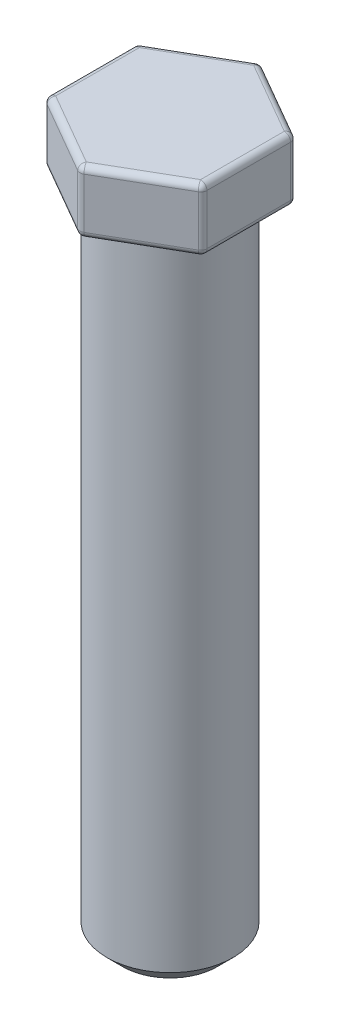
ISO-10303-21;
HEADER;
FILE_DESCRIPTION(('STEP AP214'),'2;1');
FILE_NAME('part.step','',(''),(''),'','','');
FILE_SCHEMA(('AUTOMOTIVE_DESIGN { 1 0 10303 214 1 1 1 1 }'));
ENDSEC;
DATA;
#1=APPLICATION_CONTEXT('core data for automotive mechanical design processes');
#2=APPLICATION_PROTOCOL_DEFINITION('international standard','automotive_design',2000,#1);
#3=PRODUCT_CONTEXT('',#1,'mechanical');
#4=PRODUCT('Part','Part','',(#3));
#5=PRODUCT_RELATED_PRODUCT_CATEGORY('part','',(#4));
#6=PRODUCT_DEFINITION_FORMATION('','',#4);
#7=PRODUCT_DEFINITION_CONTEXT('part definition',#1,'design');
#8=PRODUCT_DEFINITION('design','',#6,#7);
#9=PRODUCT_DEFINITION_SHAPE('','',#8);
#10=(LENGTH_UNIT() NAMED_UNIT(*) SI_UNIT(.MILLI.,.METRE.));
#11=(NAMED_UNIT(*) PLANE_ANGLE_UNIT() SI_UNIT($,.RADIAN.));
#12=(NAMED_UNIT(*) SI_UNIT($,.STERADIAN.) SOLID_ANGLE_UNIT());
#13=UNCERTAINTY_MEASURE_WITH_UNIT(LENGTH_MEASURE(1.E-05),#10,'distance_accuracy_value','');
#14=(GEOMETRIC_REPRESENTATION_CONTEXT(3) GLOBAL_UNCERTAINTY_ASSIGNED_CONTEXT((#13)) GLOBAL_UNIT_ASSIGNED_CONTEXT((#10,
#11,#12)) REPRESENTATION_CONTEXT('',''));
#15=CARTESIAN_POINT('',(0.,0.,0.));
#16=DIRECTION('',(0.,0.,1.));
#17=DIRECTION('',(1.,0.,0.));
#18=AXIS2_PLACEMENT_3D('',#15,#16,#17);
#19=CARTESIAN_POINT('',(0.,20.7,0.));
#20=DIRECTION('',(0.,-1.,0.));
#21=DIRECTION('',(0.,0.,-1.));
#22=AXIS2_PLACEMENT_3D('',#19,#20,#21);
#23=CYLINDRICAL_SURFACE('',#22,2.);
#24=CARTESIAN_POINT('',(0.,20.5,0.));
#25=DIRECTION('',(0.,1.,0.));
#26=DIRECTION('',(0.,0.,1.));
#27=AXIS2_PLACEMENT_3D('',#24,#25,#26);
#28=CIRCLE('',#27,2.);
#29=CARTESIAN_POINT('',(0.,20.5,2.));
#30=VERTEX_POINT('',#29);
#31=EDGE_CURVE('E11',#30,#30,#28,.F.);
#32=ORIENTED_EDGE('',*,*,#31,.T.);
#33=EDGE_LOOP('',(#32));
#34=FACE_BOUND('',#33,.T.);
#35=CARTESIAN_POINT('',(0.,0.499999999999997,0.));
#36=DIRECTION('',(0.,1.,0.));
#37=DIRECTION('',(0.,0.,1.));
#38=AXIS2_PLACEMENT_3D('',#35,#36,#37);
#39=CIRCLE('',#38,2.);
#40=CARTESIAN_POINT('',(0.,0.499999999999997,2.));
#41=VERTEX_POINT('',#40);
#42=EDGE_CURVE('E366',#41,#41,#39,.T.);
#43=ORIENTED_EDGE('',*,*,#42,.T.);
#44=EDGE_LOOP('',(#43));
#45=FACE_BOUND('',#44,.T.);
#46=ADVANCED_FACE('F45',(#34,#45),#23,.T.);
#47=CARTESIAN_POINT('',(0.,0.,0.));
#48=DIRECTION('',(0.,1.,0.));
#49=DIRECTION('',(0.,0.,1.));
#50=AXIS2_PLACEMENT_3D('',#47,#48,#49);
#51=PLANE('',#50);
#52=CARTESIAN_POINT('',(0.,0.,0.));
#53=DIRECTION('',(0.,1.,0.));
#54=DIRECTION('',(0.,0.,1.));
#55=AXIS2_PLACEMENT_3D('',#52,#53,#54);
#56=CIRCLE('',#55,1.5);
#57=CARTESIAN_POINT('',(0.,0.,1.5));
#58=VERTEX_POINT('',#57);
#59=EDGE_CURVE('E201',#58,#58,#56,.F.);
#60=ORIENTED_EDGE('',*,*,#59,.T.);
#61=EDGE_LOOP('',(#60));
#62=FACE_BOUND('',#61,.T.);
#63=ADVANCED_FACE('F462',(#62),#51,.F.);
#64=CARTESIAN_POINT('',(0.,22.7,2.88675134594813));
#65=DIRECTION('',(-0.5,0.,-0.866025403784439));
#66=DIRECTION('',(-0.866025403784439,0.,0.5));
#67=AXIS2_PLACEMENT_3D('',#64,#65,#66);
#68=PLANE('',#67);
#69=DIRECTION('',(0.866025403784439,0.,-0.5));
#70=VECTOR('',#69,1.);
#71=CARTESIAN_POINT('',(0.,20.9,2.88675134594813));
#72=LINE('',#71,#70);
#73=CARTESIAN_POINT('',(0.1,20.9,2.82901631902917));
#74=VERTEX_POINT('',#73);
#75=CARTESIAN_POINT('',(2.4,20.9,1.50111069989303));
#76=VERTEX_POINT('',#75);
#77=EDGE_CURVE('E257',#74,#76,#72,.T.);
#78=ORIENTED_EDGE('',*,*,#77,.T.);
#79=DIRECTION('',(0.,-1.,0.));
#80=VECTOR('',#79,1.);
#81=CARTESIAN_POINT('',(2.4,22.7,1.50111069989303));
#82=LINE('',#81,#80);
#83=CARTESIAN_POINT('',(2.4,22.5,1.50111069989303));
#84=VERTEX_POINT('',#83);
#85=EDGE_CURVE('E262',#76,#84,#82,.F.);
#86=ORIENTED_EDGE('',*,*,#85,.T.);
#87=DIRECTION('',(0.866025403784439,0.,-0.5));
#88=VECTOR('',#87,1.);
#89=CARTESIAN_POINT('',(0.,22.5,2.88675134594813));
#90=LINE('',#89,#88);
#91=CARTESIAN_POINT('',(0.1,22.5,2.82901631902917));
#92=VERTEX_POINT('',#91);
#93=EDGE_CURVE('E259',#84,#92,#90,.F.);
#94=ORIENTED_EDGE('',*,*,#93,.T.);
#95=DIRECTION('',(0.,-1.,0.));
#96=VECTOR('',#95,1.);
#97=CARTESIAN_POINT('',(0.1,22.7,2.82901631902917));
#98=LINE('',#97,#96);
#99=EDGE_CURVE('E255',#92,#74,#98,.T.);
#100=ORIENTED_EDGE('',*,*,#99,.T.);
#101=EDGE_LOOP('',(#78,#86,#94,#100));
#102=FACE_BOUND('',#101,.T.);
#103=ADVANCED_FACE('F414',(#102),#68,.F.);
#104=CARTESIAN_POINT('',(2.5,22.7,1.44337567297406));
#105=DIRECTION('',(-1.,0.,0.));
#106=DIRECTION('',(0.,0.,1.));
#107=AXIS2_PLACEMENT_3D('',#104,#105,#106);
#108=PLANE('',#107);
#109=DIRECTION('',(0.,0.,-1.));
#110=VECTOR('',#109,1.);
#111=CARTESIAN_POINT('',(2.5,22.5,1.44337567297406));
#112=LINE('',#111,#110);
#113=CARTESIAN_POINT('',(2.5,22.5,-1.32790561913614));
#114=VERTEX_POINT('',#113);
#115=CARTESIAN_POINT('',(2.5,22.5,1.32790561913614));
#116=VERTEX_POINT('',#115);
#117=EDGE_CURVE('E250',#114,#116,#112,.F.);
#118=ORIENTED_EDGE('',*,*,#117,.T.);
#119=DIRECTION('',(0.,-1.,0.));
#120=VECTOR('',#119,1.);
#121=CARTESIAN_POINT('',(2.5,22.7,1.32790561913614));
#122=LINE('',#121,#120);
#123=CARTESIAN_POINT('',(2.5,20.9,1.32790561913614));
#124=VERTEX_POINT('',#123);
#125=EDGE_CURVE('E253',#116,#124,#122,.T.);
#126=ORIENTED_EDGE('',*,*,#125,.T.);
#127=DIRECTION('',(0.,0.,-1.));
#128=VECTOR('',#127,1.);
#129=CARTESIAN_POINT('',(2.5,20.9,1.44337567297406));
#130=LINE('',#129,#128);
#131=CARTESIAN_POINT('',(2.5,20.9,-1.32790561913614));
#132=VERTEX_POINT('',#131);
#133=EDGE_CURVE('E248',#124,#132,#130,.T.);
#134=ORIENTED_EDGE('',*,*,#133,.T.);
#135=DIRECTION('',(0.,-1.,0.));
#136=VECTOR('',#135,1.);
#137=CARTESIAN_POINT('',(2.5,22.7,-1.32790561913614));
#138=LINE('',#137,#136);
#139=EDGE_CURVE('E246',#132,#114,#138,.F.);
#140=ORIENTED_EDGE('',*,*,#139,.T.);
#141=EDGE_LOOP('',(#118,#126,#134,#140));
#142=FACE_BOUND('',#141,.T.);
#143=ADVANCED_FACE('F738',(#142),#108,.F.);
#144=CARTESIAN_POINT('',(2.5,22.7,-1.44337567297406));
#145=DIRECTION('',(-0.5,0.,0.866025403784439));
#146=DIRECTION('',(0.866025403784439,0.,0.5));
#147=AXIS2_PLACEMENT_3D('',#144,#145,#146);
#148=PLANE('',#147);
#149=DIRECTION('',(-0.866025403784439,0.,-0.5));
#150=VECTOR('',#149,1.);
#151=CARTESIAN_POINT('',(2.5,22.5,-1.44337567297406));
#152=LINE('',#151,#150);
#153=CARTESIAN_POINT('',(0.1,22.5,-2.82901631902917));
#154=VERTEX_POINT('',#153);
#155=CARTESIAN_POINT('',(2.4,22.5,-1.50111069989303));
#156=VERTEX_POINT('',#155);
#157=EDGE_CURVE('E241',#154,#156,#152,.F.);
#158=ORIENTED_EDGE('',*,*,#157,.T.);
#159=DIRECTION('',(0.,-1.,0.));
#160=VECTOR('',#159,1.);
#161=CARTESIAN_POINT('',(2.4,22.7,-1.50111069989303));
#162=LINE('',#161,#160);
#163=CARTESIAN_POINT('',(2.4,20.9,-1.50111069989303));
#164=VERTEX_POINT('',#163);
#165=EDGE_CURVE('E244',#156,#164,#162,.T.);
#166=ORIENTED_EDGE('',*,*,#165,.T.);
#167=DIRECTION('',(-0.866025403784439,0.,-0.5));
#168=VECTOR('',#167,1.);
#169=CARTESIAN_POINT('',(2.5,20.9,-1.44337567297406));
#170=LINE('',#169,#168);
#171=CARTESIAN_POINT('',(0.1,20.9,-2.82901631902917));
#172=VERTEX_POINT('',#171);
#173=EDGE_CURVE('E239',#164,#172,#170,.T.);
#174=ORIENTED_EDGE('',*,*,#173,.T.);
#175=DIRECTION('',(0.,-1.,0.));
#176=VECTOR('',#175,1.);
#177=CARTESIAN_POINT('',(0.0999999999999998,22.7,-2.82901631902917));
#178=LINE('',#177,#176);
#179=EDGE_CURVE('E237',#172,#154,#178,.F.);
#180=ORIENTED_EDGE('',*,*,#179,.T.);
#181=EDGE_LOOP('',(#158,#166,#174,#180));
#182=FACE_BOUND('',#181,.T.);
#183=ADVANCED_FACE('F441',(#182),#148,.F.);
#184=CARTESIAN_POINT('',(0.,22.7,-2.88675134594813));
#185=DIRECTION('',(0.5,0.,0.866025403784439));
#186=DIRECTION('',(0.866025403784439,0.,-0.5));
#187=AXIS2_PLACEMENT_3D('',#184,#185,#186);
#188=PLANE('',#187);
#189=DIRECTION('',(-0.866025403784439,0.,0.5));
#190=VECTOR('',#189,1.);
#191=CARTESIAN_POINT('',(0.,20.9,-2.88675134594813));
#192=LINE('',#191,#190);
#193=CARTESIAN_POINT('',(-0.0999999999999998,20.9,-2.82901631902917));
#194=VERTEX_POINT('',#193);
#195=CARTESIAN_POINT('',(-2.4,20.9,-1.50111069989303));
#196=VERTEX_POINT('',#195);
#197=EDGE_CURVE('E230',#194,#196,#192,.T.);
#198=ORIENTED_EDGE('',*,*,#197,.T.);
#199=DIRECTION('',(0.,-1.,0.));
#200=VECTOR('',#199,1.);
#201=CARTESIAN_POINT('',(-2.4,22.7,-1.50111069989303));
#202=LINE('',#201,#200);
#203=CARTESIAN_POINT('',(-2.4,22.5,-1.50111069989303));
#204=VERTEX_POINT('',#203);
#205=EDGE_CURVE('E235',#196,#204,#202,.F.);
#206=ORIENTED_EDGE('',*,*,#205,.T.);
#207=DIRECTION('',(-0.866025403784439,0.,0.5));
#208=VECTOR('',#207,1.);
#209=CARTESIAN_POINT('',(0.,22.5,-2.88675134594813));
#210=LINE('',#209,#208);
#211=CARTESIAN_POINT('',(-0.0999999999999998,22.5,-2.82901631902917));
#212=VERTEX_POINT('',#211);
#213=EDGE_CURVE('E232',#204,#212,#210,.F.);
#214=ORIENTED_EDGE('',*,*,#213,.T.);
#215=DIRECTION('',(0.,-1.,0.));
#216=VECTOR('',#215,1.);
#217=CARTESIAN_POINT('',(-0.0999999999999998,22.7,-2.82901631902917));
#218=LINE('',#217,#216);
#219=EDGE_CURVE('E228',#212,#194,#218,.T.);
#220=ORIENTED_EDGE('',*,*,#219,.T.);
#221=EDGE_LOOP('',(#198,#206,#214,#220));
#222=FACE_BOUND('',#221,.T.);
#223=ADVANCED_FACE('F554',(#222),#188,.F.);
#224=CARTESIAN_POINT('',(-2.5,22.7,-1.44337567297406));
#225=DIRECTION('',(1.,0.,0.));
#226=DIRECTION('',(0.,0.,-1.));
#227=AXIS2_PLACEMENT_3D('',#224,#225,#226);
#228=PLANE('',#227);
#229=DIRECTION('',(0.,0.,1.));
#230=VECTOR('',#229,1.);
#231=CARTESIAN_POINT('',(-2.5,22.5,-1.44337567297406));
#232=LINE('',#231,#230);
#233=CARTESIAN_POINT('',(-2.5,22.5,1.32790561913614));
#234=VERTEX_POINT('',#233);
#235=CARTESIAN_POINT('',(-2.5,22.5,-1.32790561913614));
#236=VERTEX_POINT('',#235);
#237=EDGE_CURVE('E223',#234,#236,#232,.F.);
#238=ORIENTED_EDGE('',*,*,#237,.T.);
#239=DIRECTION('',(0.,-1.,0.));
#240=VECTOR('',#239,1.);
#241=CARTESIAN_POINT('',(-2.5,22.7,-1.32790561913614));
#242=LINE('',#241,#240);
#243=CARTESIAN_POINT('',(-2.5,20.9,-1.32790561913614));
#244=VERTEX_POINT('',#243);
#245=EDGE_CURVE('E226',#236,#244,#242,.T.);
#246=ORIENTED_EDGE('',*,*,#245,.T.);
#247=DIRECTION('',(0.,0.,1.));
#248=VECTOR('',#247,1.);
#249=CARTESIAN_POINT('',(-2.5,20.9,-1.44337567297406));
#250=LINE('',#249,#248);
#251=CARTESIAN_POINT('',(-2.5,20.9,1.32790561913614));
#252=VERTEX_POINT('',#251);
#253=EDGE_CURVE('E221',#244,#252,#250,.T.);
#254=ORIENTED_EDGE('',*,*,#253,.T.);
#255=DIRECTION('',(0.,-1.,0.));
#256=VECTOR('',#255,1.);
#257=CARTESIAN_POINT('',(-2.5,22.7,1.32790561913614));
#258=LINE('',#257,#256);
#259=EDGE_CURVE('E219',#252,#234,#258,.F.);
#260=ORIENTED_EDGE('',*,*,#259,.T.);
#261=EDGE_LOOP('',(#238,#246,#254,#260));
#262=FACE_BOUND('',#261,.T.);
#263=ADVANCED_FACE('F730',(#262),#228,.F.);
#264=CARTESIAN_POINT('',(-2.5,22.7,1.44337567297406));
#265=DIRECTION('',(0.5,0.,-0.866025403784439));
#266=DIRECTION('',(-0.866025403784439,0.,-0.5));
#267=AXIS2_PLACEMENT_3D('',#264,#265,#266);
#268=PLANE('',#267);
#269=DIRECTION('',(0.866025403784439,0.,0.5));
#270=VECTOR('',#269,1.);
#271=CARTESIAN_POINT('',(-2.5,22.5,1.44337567297406));
#272=LINE('',#271,#270);
#273=CARTESIAN_POINT('',(-0.0999999999999993,22.5,2.82901631902917));
#274=VERTEX_POINT('',#273);
#275=CARTESIAN_POINT('',(-2.4,22.5,1.50111069989303));
#276=VERTEX_POINT('',#275);
#277=EDGE_CURVE('E178',#274,#276,#272,.F.);
#278=ORIENTED_EDGE('',*,*,#277,.T.);
#279=DIRECTION('',(0.,-1.,0.));
#280=VECTOR('',#279,1.);
#281=CARTESIAN_POINT('',(-2.4,22.7,1.50111069989303));
#282=LINE('',#281,#280);
#283=CARTESIAN_POINT('',(-2.4,20.9,1.50111069989303));
#284=VERTEX_POINT('',#283);
#285=EDGE_CURVE('E217',#276,#284,#282,.T.);
#286=ORIENTED_EDGE('',*,*,#285,.T.);
#287=DIRECTION('',(0.866025403784439,0.,0.5));
#288=VECTOR('',#287,1.);
#289=CARTESIAN_POINT('',(-2.5,20.9,1.44337567297406));
#290=LINE('',#289,#288);
#291=CARTESIAN_POINT('',(-0.0999999999999993,20.9,2.82901631902917));
#292=VERTEX_POINT('',#291);
#293=EDGE_CURVE('E209',#284,#292,#290,.T.);
#294=ORIENTED_EDGE('',*,*,#293,.T.);
#295=DIRECTION('',(0.,-1.,0.));
#296=VECTOR('',#295,1.);
#297=CARTESIAN_POINT('',(-0.099999999999999,22.7,2.82901631902917));
#298=LINE('',#297,#296);
#299=EDGE_CURVE('E207',#292,#274,#298,.F.);
#300=ORIENTED_EDGE('',*,*,#299,.T.);
#301=EDGE_LOOP('',(#278,#286,#294,#300));
#302=FACE_BOUND('',#301,.T.);
#303=ADVANCED_FACE('F406',(#302),#268,.F.);
#304=CARTESIAN_POINT('',(0.,22.7,0.));
#305=DIRECTION('',(0.,1.,0.));
#306=DIRECTION('',(0.,0.,1.));
#307=AXIS2_PLACEMENT_3D('',#304,#305,#306);
#308=PLANE('',#307);
#309=DIRECTION('',(0.,0.,1.));
#310=VECTOR('',#309,1.);
#311=CARTESIAN_POINT('',(-2.3,22.7,1.44337567297406));
#312=LINE('',#311,#310);
#313=CARTESIAN_POINT('',(-2.3,22.7,-1.32790561913614));
#314=VERTEX_POINT('',#313);
#315=CARTESIAN_POINT('',(-2.3,22.7,1.32790561913614));
#316=VERTEX_POINT('',#315);
#317=EDGE_CURVE('E205',#314,#316,#312,.T.);
#318=ORIENTED_EDGE('',*,*,#317,.T.);
#319=DIRECTION('',(0.866025403784439,0.,0.5));
#320=VECTOR('',#319,1.);
#321=CARTESIAN_POINT('',(0.1,22.7,2.71354626519124));
#322=LINE('',#321,#320);
#323=CARTESIAN_POINT('',(0.,22.7,2.65581123827228));
#324=VERTEX_POINT('',#323);
#325=EDGE_CURVE('E176',#316,#324,#322,.T.);
#326=ORIENTED_EDGE('',*,*,#325,.T.);
#327=DIRECTION('',(0.866025403784439,0.,-0.5));
#328=VECTOR('',#327,1.);
#329=CARTESIAN_POINT('',(2.4,22.7,1.27017059221718));
#330=LINE('',#329,#328);
#331=CARTESIAN_POINT('',(2.3,22.7,1.32790561913614));
#332=VERTEX_POINT('',#331);
#333=EDGE_CURVE('E194',#324,#332,#330,.T.);
#334=ORIENTED_EDGE('',*,*,#333,.T.);
#335=DIRECTION('',(0.,0.,-1.));
#336=VECTOR('',#335,1.);
#337=CARTESIAN_POINT('',(2.3,22.7,-1.44337567297406));
#338=LINE('',#337,#336);
#339=CARTESIAN_POINT('',(2.3,22.7,-1.32790561913614));
#340=VERTEX_POINT('',#339);
#341=EDGE_CURVE('E200',#332,#340,#338,.T.);
#342=ORIENTED_EDGE('',*,*,#341,.T.);
#343=DIRECTION('',(-0.866025403784439,0.,-0.5));
#344=VECTOR('',#343,1.);
#345=CARTESIAN_POINT('',(-0.0999999999999996,22.7,-2.71354626519124));
#346=LINE('',#345,#344);
#347=CARTESIAN_POINT('',(0.,22.7,-2.65581123827228));
#348=VERTEX_POINT('',#347);
#349=EDGE_CURVE('E379',#340,#348,#346,.T.);
#350=ORIENTED_EDGE('',*,*,#349,.T.);
#351=DIRECTION('',(-0.866025403784439,0.,0.5));
#352=VECTOR('',#351,1.);
#353=CARTESIAN_POINT('',(-2.4,22.7,-1.27017059221718));
#354=LINE('',#353,#352);
#355=EDGE_CURVE('E211',#348,#314,#354,.T.);
#356=ORIENTED_EDGE('',*,*,#355,.T.);
#357=EDGE_LOOP('',(#318,#326,#334,#342,#350,#356));
#358=FACE_BOUND('',#357,.T.);
#359=ADVANCED_FACE('F203',(#358),#308,.T.);
#360=CARTESIAN_POINT('',(0.,20.7,0.));
#361=DIRECTION('',(0.,1.,0.));
#362=DIRECTION('',(0.,0.,1.));
#363=AXIS2_PLACEMENT_3D('',#360,#361,#362);
#364=PLANE('',#363);
#365=DIRECTION('',(-0.866025403784439,0.,-0.5));
#366=VECTOR('',#365,1.);
#367=CARTESIAN_POINT('',(1.15,20.7,-1.99185842870421));
#368=LINE('',#367,#366);
#369=CARTESIAN_POINT('',(0.,20.7,-2.65581123827228));
#370=VERTEX_POINT('',#369);
#371=CARTESIAN_POINT('',(2.3,20.7,-1.32790561913614));
#372=VERTEX_POINT('',#371);
#373=EDGE_CURVE('E62',#370,#372,#368,.F.);
#374=ORIENTED_EDGE('',*,*,#373,.T.);
#375=DIRECTION('',(0.,0.,-1.));
#376=VECTOR('',#375,1.);
#377=CARTESIAN_POINT('',(2.3,20.7,0.));
#378=LINE('',#377,#376);
#379=CARTESIAN_POINT('',(2.3,20.7,1.32790561913614));
#380=VERTEX_POINT('',#379);
#381=EDGE_CURVE('E54',#372,#380,#378,.F.);
#382=ORIENTED_EDGE('',*,*,#381,.T.);
#383=DIRECTION('',(0.866025403784439,0.,-0.5));
#384=VECTOR('',#383,1.);
#385=CARTESIAN_POINT('',(1.15,20.7,1.99185842870421));
#386=LINE('',#385,#384);
#387=CARTESIAN_POINT('',(0.,20.7,2.65581123827228));
#388=VERTEX_POINT('',#387);
#389=EDGE_CURVE('E267',#380,#388,#386,.F.);
#390=ORIENTED_EDGE('',*,*,#389,.T.);
#391=DIRECTION('',(0.866025403784439,0.,0.5));
#392=VECTOR('',#391,1.);
#393=CARTESIAN_POINT('',(-1.15,20.7,1.99185842870421));
#394=LINE('',#393,#392);
#395=CARTESIAN_POINT('',(-2.3,20.7,1.32790561913614));
#396=VERTEX_POINT('',#395);
#397=EDGE_CURVE('E269',#388,#396,#394,.F.);
#398=ORIENTED_EDGE('',*,*,#397,.T.);
#399=DIRECTION('',(0.,0.,1.));
#400=VECTOR('',#399,1.);
#401=CARTESIAN_POINT('',(-2.3,20.7,0.));
#402=LINE('',#401,#400);
#403=CARTESIAN_POINT('',(-2.3,20.7,-1.32790561913614));
#404=VERTEX_POINT('',#403);
#405=EDGE_CURVE('E271',#396,#404,#402,.F.);
#406=ORIENTED_EDGE('',*,*,#405,.T.);
#407=DIRECTION('',(-0.866025403784439,0.,0.5));
#408=VECTOR('',#407,1.);
#409=CARTESIAN_POINT('',(-1.15,20.7,-1.99185842870421));
#410=LINE('',#409,#408);
#411=EDGE_CURVE('E67',#404,#370,#410,.F.);
#412=ORIENTED_EDGE('',*,*,#411,.T.);
#413=EDGE_LOOP('',(#374,#382,#390,#398,#406,#412));
#414=FACE_BOUND('',#413,.T.);
#415=CARTESIAN_POINT('',(0.,20.7,0.));
#416=DIRECTION('',(0.,1.,0.));
#417=DIRECTION('',(0.,0.,1.));
#418=AXIS2_PLACEMENT_3D('',#415,#416,#417);
#419=CIRCLE('',#418,2.2);
#420=CARTESIAN_POINT('',(0.,20.7,2.2));
#421=VERTEX_POINT('',#420);
#422=EDGE_CURVE('E264',#421,#421,#419,.T.);
#423=ORIENTED_EDGE('',*,*,#422,.T.);
#424=EDGE_LOOP('',(#423));
#425=FACE_BOUND('',#424,.T.);
#426=ADVANCED_FACE('F479',(#414,#425),#364,.F.);
#427=CARTESIAN_POINT('',(0.,0.499999999999997,0.));
#428=DIRECTION('',(0.,1.,0.));
#429=DIRECTION('',(0.,0.,1.));
#430=AXIS2_PLACEMENT_3D('',#427,#428,#429);
#431=CONICAL_SURFACE('',#430,2.,0.785398163397452);
#432=ORIENTED_EDGE('',*,*,#59,.F.);
#433=EDGE_LOOP('',(#432));
#434=FACE_BOUND('',#433,.T.);
#435=ORIENTED_EDGE('',*,*,#42,.F.);
#436=EDGE_LOOP('',(#435));
#437=FACE_BOUND('',#436,.T.);
#438=ADVANCED_FACE('F473',(#434,#437),#431,.T.);
#439=CARTESIAN_POINT('',(2.4,20.9,-1.27017059221718));
#440=DIRECTION('',(-0.866025403784439,0.,-0.5));
#441=DIRECTION('',(-0.5,0.,0.866025403784439));
#442=AXIS2_PLACEMENT_3D('',#439,#440,#441);
#443=CYLINDRICAL_SURFACE('',#442,0.2);
#444=CARTESIAN_POINT('',(0.,20.9,-2.65581123827228));
#445=DIRECTION('',(-0.866025403784439,0.,-0.5));
#446=DIRECTION('',(-0.5,0.,0.866025403784439));
#447=AXIS2_PLACEMENT_3D('',#444,#445,#446);
#448=CIRCLE('',#447,0.2);
#449=EDGE_CURVE('E49',#172,#370,#448,.T.);
#450=ORIENTED_EDGE('',*,*,#449,.F.);
#451=ORIENTED_EDGE('',*,*,#173,.F.);
#452=CARTESIAN_POINT('',(2.3,20.9,-1.32790561913614));
#453=DIRECTION('',(0.866025403784439,0.,0.499999999999999));
#454=DIRECTION('',(0.499999999999999,0.,-0.866025403784439));
#455=AXIS2_PLACEMENT_3D('',#452,#453,#454);
#456=CIRCLE('',#455,0.2);
#457=EDGE_CURVE('E360',#372,#164,#456,.T.);
#458=ORIENTED_EDGE('',*,*,#457,.F.);
#459=ORIENTED_EDGE('',*,*,#373,.F.);
#460=EDGE_LOOP('',(#450,#451,#458,#459));
#461=FACE_BOUND('',#460,.T.);
#462=ADVANCED_FACE('F478',(#461),#443,.T.);
#463=CARTESIAN_POINT('',(0.,20.9,-2.65581123827228));
#464=DIRECTION('',(0.,-1.,0.));
#465=DIRECTION('',(1.,0.,0.));
#466=AXIS2_PLACEMENT_3D('',#463,#464,#465);
#467=SPHERICAL_SURFACE('',#466,0.2);
#468=CARTESIAN_POINT('',(0.,20.9,-2.65581123827228));
#469=DIRECTION('',(0.,-1.,0.));
#470=DIRECTION('',(0.,0.,-1.));
#471=AXIS2_PLACEMENT_3D('',#468,#469,#470);
#472=CIRCLE('',#471,0.2);
#473=EDGE_CURVE('E355',#172,#194,#472,.F.);
#474=ORIENTED_EDGE('',*,*,#473,.F.);
#475=ORIENTED_EDGE('',*,*,#449,.T.);
#476=CARTESIAN_POINT('',(0.,20.9,-2.65581123827228));
#477=DIRECTION('',(0.866025403784439,0.,-0.5));
#478=DIRECTION('',(-0.5,0.,-0.866025403784439));
#479=AXIS2_PLACEMENT_3D('',#476,#477,#478);
#480=CIRCLE('',#479,0.2);
#481=EDGE_CURVE('E358',#194,#370,#480,.F.);
#482=ORIENTED_EDGE('',*,*,#481,.F.);
#483=EDGE_LOOP('',(#474,#475,#482));
#484=FACE_BOUND('',#483,.T.);
#485=ADVANCED_FACE('F555',(#484),#467,.T.);
#486=CARTESIAN_POINT('',(2.3,20.9,-1.32790561913614));
#487=DIRECTION('',(0.,-1.,0.));
#488=DIRECTION('',(0.,0.,-1.));
#489=AXIS2_PLACEMENT_3D('',#486,#487,#488);
#490=SPHERICAL_SURFACE('',#489,0.2);
#491=CARTESIAN_POINT('',(2.3,20.9,-1.32790561913614));
#492=DIRECTION('',(0.,0.,-1.));
#493=DIRECTION('',(-1.,0.,0.));
#494=AXIS2_PLACEMENT_3D('',#491,#492,#493);
#495=CIRCLE('',#494,0.2);
#496=EDGE_CURVE('E349',#372,#132,#495,.F.);
#497=ORIENTED_EDGE('',*,*,#496,.F.);
#498=ORIENTED_EDGE('',*,*,#457,.T.);
#499=CARTESIAN_POINT('',(2.3,20.9,-1.32790561913614));
#500=DIRECTION('',(0.,-1.,0.));
#501=DIRECTION('',(0.,0.,-1.));
#502=AXIS2_PLACEMENT_3D('',#499,#500,#501);
#503=CIRCLE('',#502,0.2);
#504=EDGE_CURVE('E352',#132,#164,#503,.F.);
#505=ORIENTED_EDGE('',*,*,#504,.F.);
#506=EDGE_LOOP('',(#497,#498,#505));
#507=FACE_BOUND('',#506,.T.);
#508=ADVANCED_FACE('F557',(#507),#490,.T.);
#509=CARTESIAN_POINT('',(0.1,20.9,-2.71354626519124));
#510=DIRECTION('',(-0.866025403784439,0.,0.5));
#511=DIRECTION('',(0.5,0.,0.866025403784439));
#512=AXIS2_PLACEMENT_3D('',#509,#510,#511);
#513=CYLINDRICAL_SURFACE('',#512,0.2);
#514=ORIENTED_EDGE('',*,*,#481,.T.);
#515=ORIENTED_EDGE('',*,*,#411,.F.);
#516=CARTESIAN_POINT('',(-2.3,20.9,-1.32790561913614));
#517=DIRECTION('',(-0.866025403784439,0.,0.499999999999999));
#518=DIRECTION('',(0.499999999999999,0.,0.866025403784439));
#519=AXIS2_PLACEMENT_3D('',#516,#517,#518);
#520=CIRCLE('',#519,0.2);
#521=EDGE_CURVE('E346',#196,#404,#520,.T.);
#522=ORIENTED_EDGE('',*,*,#521,.F.);
#523=ORIENTED_EDGE('',*,*,#197,.F.);
#524=EDGE_LOOP('',(#514,#515,#522,#523));
#525=FACE_BOUND('',#524,.T.);
#526=ADVANCED_FACE('F549',(#525),#513,.T.);
#527=CARTESIAN_POINT('',(0.,22.7,-2.65581123827228));
#528=DIRECTION('',(0.,-1.,0.));
#529=DIRECTION('',(0.,0.,-1.));
#530=AXIS2_PLACEMENT_3D('',#527,#528,#529);
#531=CYLINDRICAL_SURFACE('',#530,0.2);
#532=ORIENTED_EDGE('',*,*,#473,.T.);
#533=ORIENTED_EDGE('',*,*,#219,.F.);
#534=CARTESIAN_POINT('',(0.,22.5,-2.65581123827228));
#535=DIRECTION('',(0.,1.,0.));
#536=DIRECTION('',(0.,0.,1.));
#537=AXIS2_PLACEMENT_3D('',#534,#535,#536);
#538=CIRCLE('',#537,0.2);
#539=EDGE_CURVE('E343',#154,#212,#538,.T.);
#540=ORIENTED_EDGE('',*,*,#539,.F.);
#541=ORIENTED_EDGE('',*,*,#179,.F.);
#542=EDGE_LOOP('',(#532,#533,#540,#541));
#543=FACE_BOUND('',#542,.T.);
#544=ADVANCED_FACE('F446',(#543),#531,.T.);
#545=CARTESIAN_POINT('',(1.15,22.5,-1.99185842870421));
#546=DIRECTION('',(0.866025403784439,0.,0.5));
#547=DIRECTION('',(0.5,0.,-0.866025403784439));
#548=AXIS2_PLACEMENT_3D('',#545,#546,#547);
#549=CYLINDRICAL_SURFACE('',#548,0.2);
#550=CARTESIAN_POINT('',(2.3,22.5,-1.32790561913614));
#551=DIRECTION('',(0.866025403784439,0.,0.499999999999999));
#552=DIRECTION('',(0.499999999999999,0.,-0.866025403784439));
#553=AXIS2_PLACEMENT_3D('',#550,#551,#552);
#554=CIRCLE('',#553,0.2);
#555=EDGE_CURVE('E337',#156,#340,#554,.T.);
#556=ORIENTED_EDGE('',*,*,#555,.F.);
#557=ORIENTED_EDGE('',*,*,#157,.F.);
#558=CARTESIAN_POINT('',(0.,22.5,-2.65581123827228));
#559=DIRECTION('',(-0.866025403784439,0.,-0.499999999999999));
#560=DIRECTION('',(-0.499999999999999,0.,0.866025403784439));
#561=AXIS2_PLACEMENT_3D('',#558,#559,#560);
#562=CIRCLE('',#561,0.2);
#563=EDGE_CURVE('E340',#348,#154,#562,.T.);
#564=ORIENTED_EDGE('',*,*,#563,.F.);
#565=ORIENTED_EDGE('',*,*,#349,.F.);
#566=EDGE_LOOP('',(#556,#557,#564,#565));
#567=FACE_BOUND('',#566,.T.);
#568=ADVANCED_FACE('F429',(#567),#549,.T.);
#569=CARTESIAN_POINT('',(2.3,22.7,-1.32790561913614));
#570=DIRECTION('',(0.,-1.,0.));
#571=DIRECTION('',(0.,0.,-1.));
#572=AXIS2_PLACEMENT_3D('',#569,#570,#571);
#573=CYLINDRICAL_SURFACE('',#572,0.2);
#574=ORIENTED_EDGE('',*,*,#504,.T.);
#575=ORIENTED_EDGE('',*,*,#165,.F.);
#576=CARTESIAN_POINT('',(2.3,22.5,-1.32790561913614));
#577=DIRECTION('',(0.,1.,0.));
#578=DIRECTION('',(0.,0.,1.));
#579=AXIS2_PLACEMENT_3D('',#576,#577,#578);
#580=CIRCLE('',#579,0.2);
#581=EDGE_CURVE('E335',#114,#156,#580,.T.);
#582=ORIENTED_EDGE('',*,*,#581,.F.);
#583=ORIENTED_EDGE('',*,*,#139,.F.);
#584=EDGE_LOOP('',(#574,#575,#582,#583));
#585=FACE_BOUND('',#584,.T.);
#586=ADVANCED_FACE('F438',(#585),#573,.T.);
#587=CARTESIAN_POINT('',(2.3,20.9,1.44337567297406));
#588=DIRECTION('',(0.,0.,-1.));
#589=DIRECTION('',(-1.,0.,0.));
#590=AXIS2_PLACEMENT_3D('',#587,#588,#589);
#591=CYLINDRICAL_SURFACE('',#590,0.2);
#592=ORIENTED_EDGE('',*,*,#496,.T.);
#593=ORIENTED_EDGE('',*,*,#133,.F.);
#594=CARTESIAN_POINT('',(2.3,20.9,1.32790561913614));
#595=DIRECTION('',(0.,0.,1.));
#596=DIRECTION('',(1.,0.,0.));
#597=AXIS2_PLACEMENT_3D('',#594,#595,#596);
#598=CIRCLE('',#597,0.2);
#599=EDGE_CURVE('E332',#380,#124,#598,.T.);
#600=ORIENTED_EDGE('',*,*,#599,.F.);
#601=ORIENTED_EDGE('',*,*,#381,.F.);
#602=EDGE_LOOP('',(#592,#593,#600,#601));
#603=FACE_BOUND('',#602,.T.);
#604=ADVANCED_FACE('F458',(#603),#591,.T.);
#605=CARTESIAN_POINT('',(-2.3,20.9,-1.32790561913614));
#606=DIRECTION('',(0.,-1.,0.));
#607=DIRECTION('',(0.,0.,-1.));
#608=AXIS2_PLACEMENT_3D('',#605,#606,#607);
#609=SPHERICAL_SURFACE('',#608,0.2);
#610=CARTESIAN_POINT('',(-2.3,20.9,-1.32790561913614));
#611=DIRECTION('',(0.,-1.,0.));
#612=DIRECTION('',(0.,0.,-1.));
#613=AXIS2_PLACEMENT_3D('',#610,#611,#612);
#614=CIRCLE('',#613,0.2);
#615=EDGE_CURVE('E326',#196,#244,#614,.F.);
#616=ORIENTED_EDGE('',*,*,#615,.F.);
#617=ORIENTED_EDGE('',*,*,#521,.T.);
#618=CARTESIAN_POINT('',(-2.3,20.9,-1.32790561913614));
#619=DIRECTION('',(0.,0.,-1.));
#620=DIRECTION('',(-1.,0.,0.));
#621=AXIS2_PLACEMENT_3D('',#618,#619,#620);
#622=CIRCLE('',#621,0.2);
#623=EDGE_CURVE('E329',#244,#404,#622,.F.);
#624=ORIENTED_EDGE('',*,*,#623,.F.);
#625=EDGE_LOOP('',(#616,#617,#624));
#626=FACE_BOUND('',#625,.T.);
#627=ADVANCED_FACE('F450',(#626),#609,.T.);
#628=CARTESIAN_POINT('',(0.,22.5,-2.65581123827228));
#629=DIRECTION('',(0.,1.,0.));
#630=DIRECTION('',(-1.,0.,0.));
#631=AXIS2_PLACEMENT_3D('',#628,#629,#630);
#632=SPHERICAL_SURFACE('',#631,0.2);
#633=ORIENTED_EDGE('',*,*,#563,.T.);
#634=ORIENTED_EDGE('',*,*,#539,.T.);
#635=CARTESIAN_POINT('',(0.,22.5,-2.65581123827228));
#636=DIRECTION('',(0.866025403784439,0.,-0.5));
#637=DIRECTION('',(-0.5,0.,-0.866025403784439));
#638=AXIS2_PLACEMENT_3D('',#635,#636,#637);
#639=CIRCLE('',#638,0.2);
#640=EDGE_CURVE('E324',#348,#212,#639,.F.);
#641=ORIENTED_EDGE('',*,*,#640,.F.);
#642=EDGE_LOOP('',(#633,#634,#641));
#643=FACE_BOUND('',#642,.T.);
#644=ADVANCED_FACE('F448',(#643),#632,.T.);
#645=CARTESIAN_POINT('',(2.3,22.5,-1.32790561913614));
#646=DIRECTION('',(0.,1.,0.));
#647=DIRECTION('',(-1.,0.,0.));
#648=AXIS2_PLACEMENT_3D('',#645,#646,#647);
#649=SPHERICAL_SURFACE('',#648,0.2);
#650=ORIENTED_EDGE('',*,*,#581,.T.);
#651=ORIENTED_EDGE('',*,*,#555,.T.);
#652=CARTESIAN_POINT('',(2.3,22.5,-1.32790561913614));
#653=DIRECTION('',(0.,0.,-1.));
#654=DIRECTION('',(-1.,0.,0.));
#655=AXIS2_PLACEMENT_3D('',#652,#653,#654);
#656=CIRCLE('',#655,0.2);
#657=EDGE_CURVE('E321',#114,#340,#656,.F.);
#658=ORIENTED_EDGE('',*,*,#657,.F.);
#659=EDGE_LOOP('',(#650,#651,#658));
#660=FACE_BOUND('',#659,.T.);
#661=ADVANCED_FACE('F434',(#660),#649,.T.);
#662=CARTESIAN_POINT('',(2.3,20.9,1.32790561913614));
#663=DIRECTION('',(0.,-1.,0.));
#664=DIRECTION('',(0.,0.,-1.));
#665=AXIS2_PLACEMENT_3D('',#662,#663,#664);
#666=SPHERICAL_SURFACE('',#665,0.2);
#667=CARTESIAN_POINT('',(2.3,20.9,1.32790561913614));
#668=DIRECTION('',(0.866025403784439,0.,-0.499999999999999));
#669=DIRECTION('',(-0.499999999999999,0.,-0.866025403784439));
#670=AXIS2_PLACEMENT_3D('',#667,#668,#669);
#671=CIRCLE('',#670,0.2);
#672=EDGE_CURVE('E315',#380,#76,#671,.F.);
#673=ORIENTED_EDGE('',*,*,#672,.F.);
#674=ORIENTED_EDGE('',*,*,#599,.T.);
#675=CARTESIAN_POINT('',(2.3,20.9,1.32790561913614));
#676=DIRECTION('',(0.,-1.,0.));
#677=DIRECTION('',(0.,0.,-1.));
#678=AXIS2_PLACEMENT_3D('',#675,#676,#677);
#679=CIRCLE('',#678,0.2);
#680=EDGE_CURVE('E318',#76,#124,#679,.F.);
#681=ORIENTED_EDGE('',*,*,#680,.F.);
#682=EDGE_LOOP('',(#673,#674,#681));
#683=FACE_BOUND('',#682,.T.);
#684=ADVANCED_FACE('F456',(#683),#666,.T.);
#685=CARTESIAN_POINT('',(-2.3,20.9,-1.44337567297406));
#686=DIRECTION('',(0.,0.,1.));
#687=DIRECTION('',(1.,0.,0.));
#688=AXIS2_PLACEMENT_3D('',#685,#686,#687);
#689=CYLINDRICAL_SURFACE('',#688,0.2);
#690=ORIENTED_EDGE('',*,*,#623,.T.);
#691=ORIENTED_EDGE('',*,*,#405,.F.);
#692=CARTESIAN_POINT('',(-2.3,20.9,1.32790561913614));
#693=DIRECTION('',(0.,0.,1.));
#694=DIRECTION('',(1.,0.,0.));
#695=AXIS2_PLACEMENT_3D('',#692,#693,#694);
#696=CIRCLE('',#695,0.2);
#697=EDGE_CURVE('E309',#252,#396,#696,.T.);
#698=ORIENTED_EDGE('',*,*,#697,.F.);
#699=ORIENTED_EDGE('',*,*,#253,.F.);
#700=EDGE_LOOP('',(#690,#691,#698,#699));
#701=FACE_BOUND('',#700,.T.);
#702=ADVANCED_FACE('F524',(#701),#689,.T.);
#703=CARTESIAN_POINT('',(-2.3,22.7,-1.32790561913614));
#704=DIRECTION('',(0.,-1.,0.));
#705=DIRECTION('',(0.,0.,-1.));
#706=AXIS2_PLACEMENT_3D('',#703,#704,#705);
#707=CYLINDRICAL_SURFACE('',#706,0.2);
#708=ORIENTED_EDGE('',*,*,#615,.T.);
#709=ORIENTED_EDGE('',*,*,#245,.F.);
#710=CARTESIAN_POINT('',(-2.3,22.5,-1.32790561913614));
#711=DIRECTION('',(0.,1.,0.));
#712=DIRECTION('',(0.,0.,1.));
#713=AXIS2_PLACEMENT_3D('',#710,#711,#712);
#714=CIRCLE('',#713,0.2);
#715=EDGE_CURVE('E306',#204,#236,#714,.T.);
#716=ORIENTED_EDGE('',*,*,#715,.F.);
#717=ORIENTED_EDGE('',*,*,#205,.F.);
#718=EDGE_LOOP('',(#708,#709,#716,#717));
#719=FACE_BOUND('',#718,.T.);
#720=ADVANCED_FACE('F521',(#719),#707,.T.);
#721=CARTESIAN_POINT('',(-1.15,22.5,-1.99185842870421));
#722=DIRECTION('',(0.866025403784439,0.,-0.5));
#723=DIRECTION('',(-0.5,0.,-0.866025403784439));
#724=AXIS2_PLACEMENT_3D('',#721,#722,#723);
#725=CYLINDRICAL_SURFACE('',#724,0.2);
#726=ORIENTED_EDGE('',*,*,#640,.T.);
#727=ORIENTED_EDGE('',*,*,#213,.F.);
#728=CARTESIAN_POINT('',(-2.3,22.5,-1.32790561913614));
#729=DIRECTION('',(-0.866025403784439,0.,0.499999999999999));
#730=DIRECTION('',(0.499999999999999,0.,0.866025403784439));
#731=AXIS2_PLACEMENT_3D('',#728,#729,#730);
#732=CIRCLE('',#731,0.2);
#733=EDGE_CURVE('E303',#314,#204,#732,.T.);
#734=ORIENTED_EDGE('',*,*,#733,.F.);
#735=ORIENTED_EDGE('',*,*,#355,.F.);
#736=EDGE_LOOP('',(#726,#727,#734,#735));
#737=FACE_BOUND('',#736,.T.);
#738=ADVANCED_FACE('F387',(#737),#725,.T.);
#739=CARTESIAN_POINT('',(2.3,22.5,0.));
#740=DIRECTION('',(0.,0.,1.));
#741=DIRECTION('',(1.,0.,0.));
#742=AXIS2_PLACEMENT_3D('',#739,#740,#741);
#743=CYLINDRICAL_SURFACE('',#742,0.2);
#744=ORIENTED_EDGE('',*,*,#657,.T.);
#745=ORIENTED_EDGE('',*,*,#341,.F.);
#746=CARTESIAN_POINT('',(2.3,22.5,1.32790561913614));
#747=DIRECTION('',(0.,0.,1.));
#748=DIRECTION('',(0.,-1.,0.));
#749=AXIS2_PLACEMENT_3D('',#746,#747,#748);
#750=CIRCLE('',#749,0.2);
#751=EDGE_CURVE('E300',#116,#332,#750,.T.);
#752=ORIENTED_EDGE('',*,*,#751,.F.);
#753=ORIENTED_EDGE('',*,*,#117,.F.);
#754=EDGE_LOOP('',(#744,#745,#752,#753));
#755=FACE_BOUND('',#754,.T.);
#756=ADVANCED_FACE('F425',(#755),#743,.T.);
#757=CARTESIAN_POINT('',(2.3,22.7,1.32790561913614));
#758=DIRECTION('',(0.,-1.,0.));
#759=DIRECTION('',(0.,0.,-1.));
#760=AXIS2_PLACEMENT_3D('',#757,#758,#759);
#761=CYLINDRICAL_SURFACE('',#760,0.2);
#762=ORIENTED_EDGE('',*,*,#680,.T.);
#763=ORIENTED_EDGE('',*,*,#125,.F.);
#764=CARTESIAN_POINT('',(2.3,22.5,1.32790561913614));
#765=DIRECTION('',(0.,1.,0.));
#766=DIRECTION('',(0.,0.,1.));
#767=AXIS2_PLACEMENT_3D('',#764,#765,#766);
#768=CIRCLE('',#767,0.2);
#769=EDGE_CURVE('E298',#84,#116,#768,.T.);
#770=ORIENTED_EDGE('',*,*,#769,.F.);
#771=ORIENTED_EDGE('',*,*,#85,.F.);
#772=EDGE_LOOP('',(#762,#763,#770,#771));
#773=FACE_BOUND('',#772,.T.);
#774=ADVANCED_FACE('F419',(#773),#761,.T.);
#775=CARTESIAN_POINT('',(-0.0999999999999995,20.9,2.71354626519124));
#776=DIRECTION('',(0.866025403784439,0.,-0.5));
#777=DIRECTION('',(-0.5,0.,-0.866025403784439));
#778=AXIS2_PLACEMENT_3D('',#775,#776,#777);
#779=CYLINDRICAL_SURFACE('',#778,0.2);
#780=ORIENTED_EDGE('',*,*,#672,.T.);
#781=ORIENTED_EDGE('',*,*,#77,.F.);
#782=CARTESIAN_POINT('',(0.,20.9,2.65581123827228));
#783=DIRECTION('',(-0.866025403784439,0.,0.5));
#784=DIRECTION('',(0.5,0.,0.866025403784439));
#785=AXIS2_PLACEMENT_3D('',#782,#783,#784);
#786=CIRCLE('',#785,0.2);
#787=EDGE_CURVE('E295',#388,#74,#786,.T.);
#788=ORIENTED_EDGE('',*,*,#787,.F.);
#789=ORIENTED_EDGE('',*,*,#389,.F.);
#790=EDGE_LOOP('',(#780,#781,#788,#789));
#791=FACE_BOUND('',#790,.T.);
#792=ADVANCED_FACE('F510',(#791),#779,.T.);
#793=CARTESIAN_POINT('',(-2.4,20.9,1.27017059221718));
#794=DIRECTION('',(0.866025403784439,0.,0.5));
#795=DIRECTION('',(0.5,0.,-0.866025403784439));
#796=AXIS2_PLACEMENT_3D('',#793,#794,#795);
#797=CYLINDRICAL_SURFACE('',#796,0.2);
#798=CARTESIAN_POINT('',(-2.3,20.9,1.32790561913614));
#799=DIRECTION('',(-0.866025403784439,0.,-0.499999999999999));
#800=DIRECTION('',(-0.499999999999999,0.,0.866025403784439));
#801=AXIS2_PLACEMENT_3D('',#798,#799,#800);
#802=CIRCLE('',#801,0.2);
#803=EDGE_CURVE('E312',#396,#284,#802,.T.);
#804=ORIENTED_EDGE('',*,*,#803,.F.);
#805=ORIENTED_EDGE('',*,*,#397,.F.);
#806=CARTESIAN_POINT('',(0.,20.9,2.65581123827228));
#807=DIRECTION('',(0.866025403784439,0.,0.5));
#808=DIRECTION('',(0.5,0.,-0.866025403784439));
#809=AXIS2_PLACEMENT_3D('',#806,#807,#808);
#810=CIRCLE('',#809,0.2);
#811=EDGE_CURVE('E292',#292,#388,#810,.T.);
#812=ORIENTED_EDGE('',*,*,#811,.F.);
#813=ORIENTED_EDGE('',*,*,#293,.F.);
#814=EDGE_LOOP('',(#804,#805,#812,#813));
#815=FACE_BOUND('',#814,.T.);
#816=ADVANCED_FACE('F506',(#815),#797,.T.);
#817=CARTESIAN_POINT('',(-2.3,20.9,1.32790561913614));
#818=DIRECTION('',(0.,-1.,0.));
#819=DIRECTION('',(0.,0.,-1.));
#820=AXIS2_PLACEMENT_3D('',#817,#818,#819);
#821=SPHERICAL_SURFACE('',#820,0.2);
#822=ORIENTED_EDGE('',*,*,#697,.T.);
#823=ORIENTED_EDGE('',*,*,#803,.T.);
#824=CARTESIAN_POINT('',(-2.3,20.9,1.32790561913614));
#825=DIRECTION('',(0.,-1.,0.));
#826=DIRECTION('',(0.,0.,-1.));
#827=AXIS2_PLACEMENT_3D('',#824,#825,#826);
#828=CIRCLE('',#827,0.2);
#829=EDGE_CURVE('E289',#252,#284,#828,.F.);
#830=ORIENTED_EDGE('',*,*,#829,.F.);
#831=EDGE_LOOP('',(#822,#823,#830));
#832=FACE_BOUND('',#831,.T.);
#833=ADVANCED_FACE('F503',(#832),#821,.T.);
#834=CARTESIAN_POINT('',(-2.3,22.5,-1.32790561913614));
#835=DIRECTION('',(0.,1.,0.));
#836=DIRECTION('',(0.,0.,1.));
#837=AXIS2_PLACEMENT_3D('',#834,#835,#836);
#838=SPHERICAL_SURFACE('',#837,0.2);
#839=ORIENTED_EDGE('',*,*,#733,.T.);
#840=ORIENTED_EDGE('',*,*,#715,.T.);
#841=CARTESIAN_POINT('',(-2.3,22.5,-1.32790561913614));
#842=DIRECTION('',(0.,0.,-1.));
#843=DIRECTION('',(0.,1.,0.));
#844=AXIS2_PLACEMENT_3D('',#841,#842,#843);
#845=CIRCLE('',#844,0.2);
#846=EDGE_CURVE('E287',#314,#236,#845,.F.);
#847=ORIENTED_EDGE('',*,*,#846,.F.);
#848=EDGE_LOOP('',(#839,#840,#847));
#849=FACE_BOUND('',#848,.T.);
#850=ADVANCED_FACE('F390',(#849),#838,.T.);
#851=CARTESIAN_POINT('',(2.3,22.5,1.32790561913614));
#852=DIRECTION('',(0.,1.,0.));
#853=DIRECTION('',(-1.,0.,0.));
#854=AXIS2_PLACEMENT_3D('',#851,#852,#853);
#855=SPHERICAL_SURFACE('',#854,0.2);
#856=ORIENTED_EDGE('',*,*,#769,.T.);
#857=ORIENTED_EDGE('',*,*,#751,.T.);
#858=CARTESIAN_POINT('',(2.3,22.5,1.32790561913614));
#859=DIRECTION('',(0.86602540378444,0.,-0.499999999999997));
#860=DIRECTION('',(-0.499999999999997,0.,-0.86602540378444));
#861=AXIS2_PLACEMENT_3D('',#858,#859,#860);
#862=CIRCLE('',#861,0.2);
#863=EDGE_CURVE('E197',#84,#332,#862,.F.);
#864=ORIENTED_EDGE('',*,*,#863,.F.);
#865=EDGE_LOOP('',(#856,#857,#864));
#866=FACE_BOUND('',#865,.T.);
#867=ADVANCED_FACE('F422',(#866),#855,.T.);
#868=CARTESIAN_POINT('',(0.,20.9,2.65581123827228));
#869=DIRECTION('',(0.,-1.,0.));
#870=DIRECTION('',(1.,0.,0.));
#871=AXIS2_PLACEMENT_3D('',#868,#869,#870);
#872=SPHERICAL_SURFACE('',#871,0.2);
#873=ORIENTED_EDGE('',*,*,#811,.T.);
#874=ORIENTED_EDGE('',*,*,#787,.T.);
#875=CARTESIAN_POINT('',(0.,20.9,2.65581123827228));
#876=DIRECTION('',(0.,-1.,0.));
#877=DIRECTION('',(0.,0.,-1.));
#878=AXIS2_PLACEMENT_3D('',#875,#876,#877);
#879=CIRCLE('',#878,0.2);
#880=EDGE_CURVE('E283',#292,#74,#879,.F.);
#881=ORIENTED_EDGE('',*,*,#880,.F.);
#882=EDGE_LOOP('',(#873,#874,#881));
#883=FACE_BOUND('',#882,.T.);
#884=ADVANCED_FACE('F495',(#883),#872,.T.);
#885=CARTESIAN_POINT('',(-2.3,22.7,1.32790561913614));
#886=DIRECTION('',(0.,-1.,0.));
#887=DIRECTION('',(0.,0.,-1.));
#888=AXIS2_PLACEMENT_3D('',#885,#886,#887);
#889=CYLINDRICAL_SURFACE('',#888,0.2);
#890=ORIENTED_EDGE('',*,*,#829,.T.);
#891=ORIENTED_EDGE('',*,*,#285,.F.);
#892=CARTESIAN_POINT('',(-2.3,22.5,1.32790561913614));
#893=DIRECTION('',(0.,1.,0.));
#894=DIRECTION('',(0.,0.,1.));
#895=AXIS2_PLACEMENT_3D('',#892,#893,#894);
#896=CIRCLE('',#895,0.2);
#897=EDGE_CURVE('E280',#234,#276,#896,.T.);
#898=ORIENTED_EDGE('',*,*,#897,.F.);
#899=ORIENTED_EDGE('',*,*,#259,.F.);
#900=EDGE_LOOP('',(#890,#891,#898,#899));
#901=FACE_BOUND('',#900,.T.);
#902=ADVANCED_FACE('F402',(#901),#889,.T.);
#903=CARTESIAN_POINT('',(-2.3,22.5,0.));
#904=DIRECTION('',(0.,0.,-1.));
#905=DIRECTION('',(-1.,0.,0.));
#906=AXIS2_PLACEMENT_3D('',#903,#904,#905);
#907=CYLINDRICAL_SURFACE('',#906,0.2);
#908=ORIENTED_EDGE('',*,*,#846,.T.);
#909=ORIENTED_EDGE('',*,*,#237,.F.);
#910=CARTESIAN_POINT('',(-2.3,22.5,1.32790561913614));
#911=DIRECTION('',(0.,0.,1.));
#912=DIRECTION('',(1.,0.,0.));
#913=AXIS2_PLACEMENT_3D('',#910,#911,#912);
#914=CIRCLE('',#913,0.2);
#915=EDGE_CURVE('E191',#316,#234,#914,.T.);
#916=ORIENTED_EDGE('',*,*,#915,.F.);
#917=ORIENTED_EDGE('',*,*,#317,.F.);
#918=EDGE_LOOP('',(#908,#909,#916,#917));
#919=FACE_BOUND('',#918,.T.);
#920=ADVANCED_FACE('F394',(#919),#907,.T.);
#921=CARTESIAN_POINT('',(1.15,22.5,1.99185842870421));
#922=DIRECTION('',(-0.866025403784439,0.,0.5));
#923=DIRECTION('',(0.5,0.,0.866025403784439));
#924=AXIS2_PLACEMENT_3D('',#921,#922,#923);
#925=CYLINDRICAL_SURFACE('',#924,0.2);
#926=ORIENTED_EDGE('',*,*,#863,.T.);
#927=ORIENTED_EDGE('',*,*,#333,.F.);
#928=CARTESIAN_POINT('',(0.,22.5,2.65581123827228));
#929=DIRECTION('',(-0.866025403784439,0.,0.5));
#930=DIRECTION('',(0.5,0.,0.866025403784439));
#931=AXIS2_PLACEMENT_3D('',#928,#929,#930);
#932=CIRCLE('',#931,0.2);
#933=EDGE_CURVE('E183',#92,#324,#932,.T.);
#934=ORIENTED_EDGE('',*,*,#933,.F.);
#935=ORIENTED_EDGE('',*,*,#93,.F.);
#936=EDGE_LOOP('',(#926,#927,#934,#935));
#937=FACE_BOUND('',#936,.T.);
#938=ADVANCED_FACE('F195',(#937),#925,.T.);
#939=CARTESIAN_POINT('',(0.,22.7,2.65581123827228));
#940=DIRECTION('',(0.,-1.,0.));
#941=DIRECTION('',(0.,0.,-1.));
#942=AXIS2_PLACEMENT_3D('',#939,#940,#941);
#943=CYLINDRICAL_SURFACE('',#942,0.2);
#944=ORIENTED_EDGE('',*,*,#880,.T.);
#945=ORIENTED_EDGE('',*,*,#99,.F.);
#946=CARTESIAN_POINT('',(0.,22.5,2.65581123827228));
#947=DIRECTION('',(0.,1.,0.));
#948=DIRECTION('',(0.,0.,1.));
#949=AXIS2_PLACEMENT_3D('',#946,#947,#948);
#950=CIRCLE('',#949,0.2);
#951=EDGE_CURVE('E187',#274,#92,#950,.T.);
#952=ORIENTED_EDGE('',*,*,#951,.F.);
#953=ORIENTED_EDGE('',*,*,#299,.F.);
#954=EDGE_LOOP('',(#944,#945,#952,#953));
#955=FACE_BOUND('',#954,.T.);
#956=ADVANCED_FACE('F410',(#955),#943,.T.);
#957=CARTESIAN_POINT('',(-2.3,22.5,1.32790561913614));
#958=DIRECTION('',(0.,1.,0.));
#959=DIRECTION('',(0.,0.,1.));
#960=AXIS2_PLACEMENT_3D('',#957,#958,#959);
#961=SPHERICAL_SURFACE('',#960,0.2);
#962=ORIENTED_EDGE('',*,*,#915,.T.);
#963=ORIENTED_EDGE('',*,*,#897,.T.);
#964=CARTESIAN_POINT('',(-2.3,22.5,1.32790561913614));
#965=DIRECTION('',(-0.866025403784439,0.,-0.499999999999999));
#966=DIRECTION('',(-0.499999999999999,0.,0.866025403784439));
#967=AXIS2_PLACEMENT_3D('',#964,#965,#966);
#968=CIRCLE('',#967,0.2);
#969=EDGE_CURVE('E180',#316,#276,#968,.F.);
#970=ORIENTED_EDGE('',*,*,#969,.F.);
#971=EDGE_LOOP('',(#962,#963,#970));
#972=FACE_BOUND('',#971,.T.);
#973=ADVANCED_FACE('F398',(#972),#961,.T.);
#974=CARTESIAN_POINT('',(0.,22.5,2.65581123827228));
#975=DIRECTION('',(0.,1.,0.));
#976=DIRECTION('',(-1.,0.,0.));
#977=AXIS2_PLACEMENT_3D('',#974,#975,#976);
#978=SPHERICAL_SURFACE('',#977,0.2);
#979=ORIENTED_EDGE('',*,*,#951,.T.);
#980=ORIENTED_EDGE('',*,*,#933,.T.);
#981=CARTESIAN_POINT('',(0.,22.5,2.65581123827228));
#982=DIRECTION('',(0.866025403784439,0.,0.5));
#983=DIRECTION('',(0.5,0.,-0.866025403784439));
#984=AXIS2_PLACEMENT_3D('',#981,#982,#983);
#985=CIRCLE('',#984,0.2);
#986=EDGE_CURVE('E172',#274,#324,#985,.F.);
#987=ORIENTED_EDGE('',*,*,#986,.F.);
#988=EDGE_LOOP('',(#979,#980,#987));
#989=FACE_BOUND('',#988,.T.);
#990=ADVANCED_FACE('F185',(#989),#978,.T.);
#991=CARTESIAN_POINT('',(-1.15,22.5,1.99185842870421));
#992=DIRECTION('',(-0.866025403784439,0.,-0.5));
#993=DIRECTION('',(-0.5,0.,0.866025403784439));
#994=AXIS2_PLACEMENT_3D('',#991,#992,#993);
#995=CYLINDRICAL_SURFACE('',#994,0.2);
#996=ORIENTED_EDGE('',*,*,#969,.T.);
#997=ORIENTED_EDGE('',*,*,#277,.F.);
#998=ORIENTED_EDGE('',*,*,#986,.T.);
#999=ORIENTED_EDGE('',*,*,#325,.F.);
#1000=EDGE_LOOP('',(#996,#997,#998,#999));
#1001=FACE_BOUND('',#1000,.T.);
#1002=ADVANCED_FACE('F174',(#1001),#995,.T.);
#1003=CARTESIAN_POINT('',(0.,20.5,0.));
#1004=DIRECTION('',(0.,1.,0.));
#1005=DIRECTION('',(0.,0.,1.));
#1006=AXIS2_PLACEMENT_3D('',#1003,#1004,#1005);
#1007=TOROIDAL_SURFACE('',#1006,2.2,0.2);
#1008=ORIENTED_EDGE('',*,*,#31,.F.);
#1009=EDGE_LOOP('',(#1008));
#1010=FACE_BOUND('',#1009,.T.);
#1011=ORIENTED_EDGE('',*,*,#422,.F.);
#1012=EDGE_LOOP('',(#1011));
#1013=FACE_BOUND('',#1012,.T.);
#1014=ADVANCED_FACE('F47',(#1010,#1013),#1007,.F.);
#1015=CLOSED_SHELL('',(#46,#63,#103,#143,#183,#223,#263,#303,#359,#426,#438,#462,#485,#508,#526,
#544,#568,#586,#604,#627,#644,#661,#684,#702,#720,#738,#756,#774,#792,#816,#833,#850,#867,#884,
#902,#920,#938,#956,#973,#990,#1002,#1014));
#1016=MANIFOLD_SOLID_BREP('B2',#1015);
#1017=ADVANCED_BREP_SHAPE_REPRESENTATION('',(#18,#1016),#14);
#1018=SHAPE_DEFINITION_REPRESENTATION(#9,#1017);
ENDSEC;
END-ISO-10303-21;
